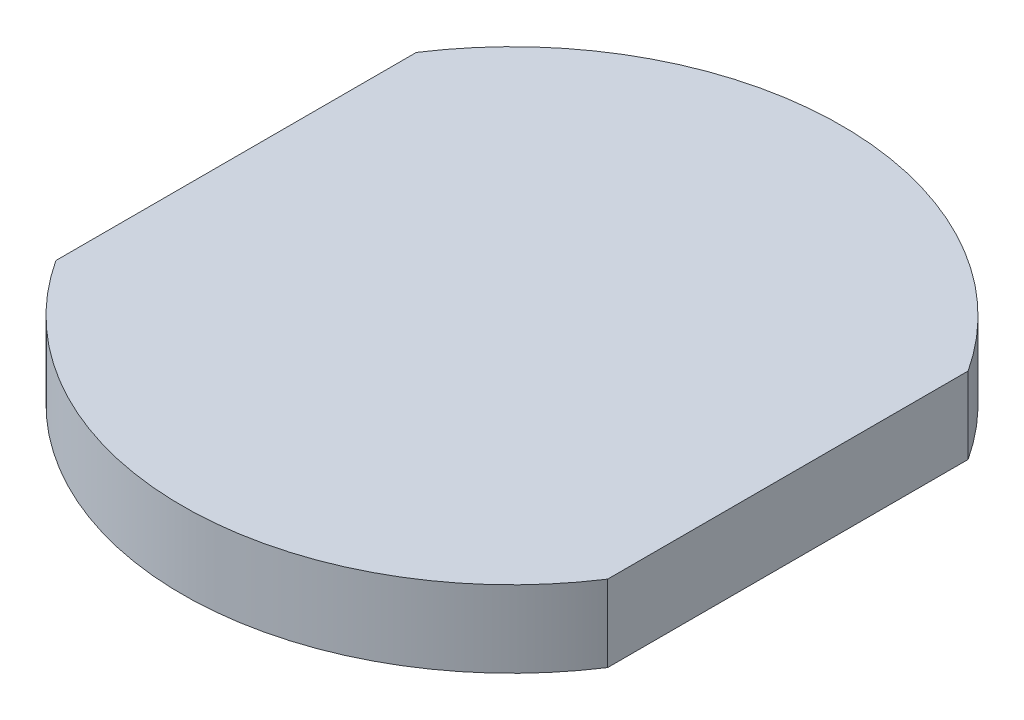
ISO-10303-21;
HEADER;
FILE_DESCRIPTION(('STEP AP214'),'2;1');
FILE_NAME('part.step','',(''),(''),'','','');
FILE_SCHEMA(('AUTOMOTIVE_DESIGN { 1 0 10303 214 1 1 1 1 }'));
ENDSEC;
DATA;
#1=APPLICATION_CONTEXT('core data for automotive mechanical design processes');
#2=APPLICATION_PROTOCOL_DEFINITION('international standard','automotive_design',2000,#1);
#3=PRODUCT_CONTEXT('',#1,'mechanical');
#4=PRODUCT('Part','Part','',(#3));
#5=PRODUCT_RELATED_PRODUCT_CATEGORY('part','',(#4));
#6=PRODUCT_DEFINITION_FORMATION('','',#4);
#7=PRODUCT_DEFINITION_CONTEXT('part definition',#1,'design');
#8=PRODUCT_DEFINITION('design','',#6,#7);
#9=PRODUCT_DEFINITION_SHAPE('','',#8);
#10=(LENGTH_UNIT() NAMED_UNIT(*) SI_UNIT(.MILLI.,.METRE.));
#11=(NAMED_UNIT(*) PLANE_ANGLE_UNIT() SI_UNIT($,.RADIAN.));
#12=(NAMED_UNIT(*) SI_UNIT($,.STERADIAN.) SOLID_ANGLE_UNIT());
#13=UNCERTAINTY_MEASURE_WITH_UNIT(LENGTH_MEASURE(1.E-05),#10,'distance_accuracy_value','');
#14=(GEOMETRIC_REPRESENTATION_CONTEXT(3) GLOBAL_UNCERTAINTY_ASSIGNED_CONTEXT((#13)) GLOBAL_UNIT_ASSIGNED_CONTEXT((#10,
#11,#12)) REPRESENTATION_CONTEXT('',''));
#15=CARTESIAN_POINT('',(0.,0.,0.));
#16=DIRECTION('',(0.,0.,1.));
#17=DIRECTION('',(1.,0.,0.));
#18=AXIS2_PLACEMENT_3D('',#15,#16,#17);
#19=CARTESIAN_POINT('',(0.,-5.,0.));
#20=DIRECTION('',(0.,1.,0.));
#21=DIRECTION('',(0.,0.,1.));
#22=AXIS2_PLACEMENT_3D('',#19,#20,#21);
#23=CYLINDRICAL_SURFACE('',#22,21.5);
#24=CARTESIAN_POINT('',(0.,0.,0.));
#25=DIRECTION('',(0.,1.,0.));
#26=DIRECTION('',(0.,0.,1.));
#27=AXIS2_PLACEMENT_3D('',#24,#25,#26);
#28=CIRCLE('',#27,21.5);
#29=CARTESIAN_POINT('',(-18.,0.,11.7579760163049));
#30=VERTEX_POINT('',#29);
#31=CARTESIAN_POINT('',(18.,0.,11.7579760163049));
#32=VERTEX_POINT('',#31);
#33=EDGE_CURVE('E96',#30,#32,#28,.T.);
#34=ORIENTED_EDGE('',*,*,#33,.F.);
#35=DIRECTION('',(0.,1.,0.));
#36=VECTOR('',#35,1.);
#37=CARTESIAN_POINT('',(-18.,-5.,11.7579760163049));
#38=LINE('',#37,#36);
#39=CARTESIAN_POINT('',(-18.,-5.,11.7579760163049));
#40=VERTEX_POINT('',#39);
#41=EDGE_CURVE('E11',#40,#30,#38,.T.);
#42=ORIENTED_EDGE('',*,*,#41,.F.);
#43=CARTESIAN_POINT('',(0.,-5.,0.));
#44=DIRECTION('',(0.,1.,0.));
#45=DIRECTION('',(0.,0.,1.));
#46=AXIS2_PLACEMENT_3D('',#43,#44,#45);
#47=CIRCLE('',#46,21.5);
#48=CARTESIAN_POINT('',(18.,-5.,11.7579760163049));
#49=VERTEX_POINT('',#48);
#50=EDGE_CURVE('E90',#40,#49,#47,.T.);
#51=ORIENTED_EDGE('',*,*,#50,.T.);
#52=DIRECTION('',(0.,1.,0.));
#53=VECTOR('',#52,1.);
#54=CARTESIAN_POINT('',(18.,-5.,11.7579760163049));
#55=LINE('',#54,#53);
#56=EDGE_CURVE('E35',#49,#32,#55,.T.);
#57=ORIENTED_EDGE('',*,*,#56,.T.);
#58=EDGE_LOOP('',(#34,#42,#51,#57));
#59=FACE_BOUND('',#58,.T.);
#60=ADVANCED_FACE('F32',(#59),#23,.T.);
#61=CARTESIAN_POINT('',(-18.,-5.,11.7579760163049));
#62=DIRECTION('',(-1.,0.,0.));
#63=DIRECTION('',(0.,0.,1.));
#64=AXIS2_PLACEMENT_3D('',#61,#62,#63);
#65=PLANE('',#64);
#66=DIRECTION('',(0.,0.,1.));
#67=VECTOR('',#66,1.);
#68=CARTESIAN_POINT('',(-18.,0.,11.7579760163049));
#69=LINE('',#68,#67);
#70=CARTESIAN_POINT('',(-18.,0.,-11.7579760163048));
#71=VERTEX_POINT('',#70);
#72=EDGE_CURVE('E92',#71,#30,#69,.T.);
#73=ORIENTED_EDGE('',*,*,#72,.F.);
#74=DIRECTION('',(0.,1.,0.));
#75=VECTOR('',#74,1.);
#76=CARTESIAN_POINT('',(-18.,-5.,-11.7579760163048));
#77=LINE('',#76,#75);
#78=CARTESIAN_POINT('',(-18.,-5.,-11.7579760163048));
#79=VERTEX_POINT('',#78);
#80=EDGE_CURVE('E41',#79,#71,#77,.T.);
#81=ORIENTED_EDGE('',*,*,#80,.F.);
#82=DIRECTION('',(0.,0.,1.));
#83=VECTOR('',#82,1.);
#84=CARTESIAN_POINT('',(-18.,-5.,11.7579760163049));
#85=LINE('',#84,#83);
#86=EDGE_CURVE('E87',#79,#40,#85,.T.);
#87=ORIENTED_EDGE('',*,*,#86,.T.);
#88=ORIENTED_EDGE('',*,*,#41,.T.);
#89=EDGE_LOOP('',(#73,#81,#87,#88));
#90=FACE_BOUND('',#89,.T.);
#91=ADVANCED_FACE('F106',(#90),#65,.T.);
#92=CARTESIAN_POINT('',(0.,-5.,0.));
#93=DIRECTION('',(0.,1.,0.));
#94=DIRECTION('',(0.,0.,1.));
#95=AXIS2_PLACEMENT_3D('',#92,#93,#94);
#96=CYLINDRICAL_SURFACE('',#95,21.5);
#97=CARTESIAN_POINT('',(0.,0.,0.));
#98=DIRECTION('',(0.,1.,0.));
#99=DIRECTION('',(0.,0.,1.));
#100=AXIS2_PLACEMENT_3D('',#97,#98,#99);
#101=CIRCLE('',#100,21.5);
#102=CARTESIAN_POINT('',(18.,0.,-11.7579760163048));
#103=VERTEX_POINT('',#102);
#104=EDGE_CURVE('E82',#103,#71,#101,.T.);
#105=ORIENTED_EDGE('',*,*,#104,.F.);
#106=DIRECTION('',(0.,1.,0.));
#107=VECTOR('',#106,1.);
#108=CARTESIAN_POINT('',(18.,-5.,-11.7579760163048));
#109=LINE('',#108,#107);
#110=CARTESIAN_POINT('',(18.,-5.,-11.7579760163048));
#111=VERTEX_POINT('',#110);
#112=EDGE_CURVE('E77',#111,#103,#109,.T.);
#113=ORIENTED_EDGE('',*,*,#112,.F.);
#114=CARTESIAN_POINT('',(0.,-5.,0.));
#115=DIRECTION('',(0.,1.,0.));
#116=DIRECTION('',(0.,0.,1.));
#117=AXIS2_PLACEMENT_3D('',#114,#115,#116);
#118=CIRCLE('',#117,21.5);
#119=EDGE_CURVE('E80',#111,#79,#118,.T.);
#120=ORIENTED_EDGE('',*,*,#119,.T.);
#121=ORIENTED_EDGE('',*,*,#80,.T.);
#122=EDGE_LOOP('',(#105,#113,#120,#121));
#123=FACE_BOUND('',#122,.T.);
#124=ADVANCED_FACE('F79',(#123),#96,.T.);
#125=CARTESIAN_POINT('',(18.,-5.,11.7579760163049));
#126=DIRECTION('',(1.,0.,0.));
#127=DIRECTION('',(0.,0.,-1.));
#128=AXIS2_PLACEMENT_3D('',#125,#126,#127);
#129=PLANE('',#128);
#130=DIRECTION('',(0.,0.,-1.));
#131=VECTOR('',#130,1.);
#132=CARTESIAN_POINT('',(18.,0.,11.7579760163049));
#133=LINE('',#132,#131);
#134=EDGE_CURVE('E99',#32,#103,#133,.T.);
#135=ORIENTED_EDGE('',*,*,#134,.F.);
#136=ORIENTED_EDGE('',*,*,#56,.F.);
#137=DIRECTION('',(0.,0.,-1.));
#138=VECTOR('',#137,1.);
#139=CARTESIAN_POINT('',(18.,-5.,11.7579760163049));
#140=LINE('',#139,#138);
#141=EDGE_CURVE('E86',#49,#111,#140,.T.);
#142=ORIENTED_EDGE('',*,*,#141,.T.);
#143=ORIENTED_EDGE('',*,*,#112,.T.);
#144=EDGE_LOOP('',(#135,#136,#142,#143));
#145=FACE_BOUND('',#144,.T.);
#146=ADVANCED_FACE('F89',(#145),#129,.T.);
#147=CARTESIAN_POINT('',(0.,-5.,0.));
#148=DIRECTION('',(0.,1.,0.));
#149=DIRECTION('',(0.,0.,1.));
#150=AXIS2_PLACEMENT_3D('',#147,#148,#149);
#151=PLANE('',#150);
#152=ORIENTED_EDGE('',*,*,#50,.F.);
#153=ORIENTED_EDGE('',*,*,#86,.F.);
#154=ORIENTED_EDGE('',*,*,#119,.F.);
#155=ORIENTED_EDGE('',*,*,#141,.F.);
#156=EDGE_LOOP('',(#152,#153,#154,#155));
#157=FACE_BOUND('',#156,.T.);
#158=ADVANCED_FACE('F85',(#157),#151,.F.);
#159=CARTESIAN_POINT('',(0.,0.,0.));
#160=DIRECTION('',(0.,1.,0.));
#161=DIRECTION('',(0.,0.,1.));
#162=AXIS2_PLACEMENT_3D('',#159,#160,#161);
#163=PLANE('',#162);
#164=ORIENTED_EDGE('',*,*,#33,.T.);
#165=ORIENTED_EDGE('',*,*,#134,.T.);
#166=ORIENTED_EDGE('',*,*,#104,.T.);
#167=ORIENTED_EDGE('',*,*,#72,.T.);
#168=EDGE_LOOP('',(#164,#165,#166,#167));
#169=FACE_BOUND('',#168,.T.);
#170=ADVANCED_FACE('F105',(#169),#163,.T.);
#171=CLOSED_SHELL('',(#60,#91,#124,#146,#158,#170));
#172=MANIFOLD_SOLID_BREP('B2',#171);
#173=ADVANCED_BREP_SHAPE_REPRESENTATION('',(#18,#172),#14);
#174=SHAPE_DEFINITION_REPRESENTATION(#9,#173);
ENDSEC;
END-ISO-10303-21;
